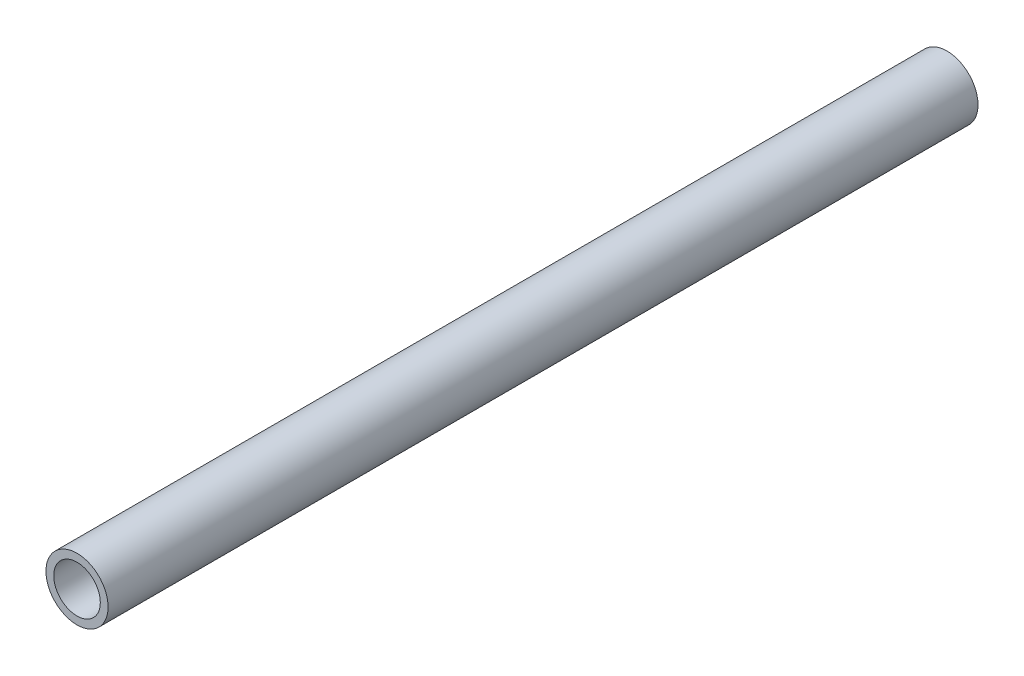
ISO-10303-21;
HEADER;
FILE_DESCRIPTION(('STEP AP214'),'2;1');
FILE_NAME('part.step','',(''),(''),'','','');
FILE_SCHEMA(('AUTOMOTIVE_DESIGN { 1 0 10303 214 1 1 1 1 }'));
ENDSEC;
DATA;
#1=APPLICATION_CONTEXT('core data for automotive mechanical design processes');
#2=APPLICATION_PROTOCOL_DEFINITION('international standard','automotive_design',2000,#1);
#3=PRODUCT_CONTEXT('',#1,'mechanical');
#4=PRODUCT('Part','Part','',(#3));
#5=PRODUCT_RELATED_PRODUCT_CATEGORY('part','',(#4));
#6=PRODUCT_DEFINITION_FORMATION('','',#4);
#7=PRODUCT_DEFINITION_CONTEXT('part definition',#1,'design');
#8=PRODUCT_DEFINITION('design','',#6,#7);
#9=PRODUCT_DEFINITION_SHAPE('','',#8);
#10=(LENGTH_UNIT() NAMED_UNIT(*) SI_UNIT(.MILLI.,.METRE.));
#11=(NAMED_UNIT(*) PLANE_ANGLE_UNIT() SI_UNIT($,.RADIAN.));
#12=(NAMED_UNIT(*) SI_UNIT($,.STERADIAN.) SOLID_ANGLE_UNIT());
#13=UNCERTAINTY_MEASURE_WITH_UNIT(LENGTH_MEASURE(1.E-05),#10,'distance_accuracy_value','');
#14=(GEOMETRIC_REPRESENTATION_CONTEXT(3) GLOBAL_UNCERTAINTY_ASSIGNED_CONTEXT((#13)) GLOBAL_UNIT_ASSIGNED_CONTEXT((#10,
#11,#12)) REPRESENTATION_CONTEXT('',''));
#15=CARTESIAN_POINT('',(0.,0.,0.));
#16=DIRECTION('',(0.,0.,1.));
#17=DIRECTION('',(1.,0.,0.));
#18=AXIS2_PLACEMENT_3D('',#15,#16,#17);
#19=CARTESIAN_POINT('',(0.,0.,355.6));
#20=DIRECTION('',(0.,0.,1.));
#21=DIRECTION('',(1.,0.,0.));
#22=AXIS2_PLACEMENT_3D('',#19,#20,#21);
#23=CYLINDRICAL_SURFACE('',#22,9.525);
#24=CARTESIAN_POINT('',(0.,0.,355.6));
#25=DIRECTION('',(0.,0.,1.));
#26=DIRECTION('',(1.,0.,0.));
#27=AXIS2_PLACEMENT_3D('',#24,#25,#26);
#28=CIRCLE('',#27,9.525);
#29=CARTESIAN_POINT('',(9.525,0.,355.6));
#30=VERTEX_POINT('',#29);
#31=EDGE_CURVE('E17',#30,#30,#28,.F.);
#32=ORIENTED_EDGE('',*,*,#31,.F.);
#33=EDGE_LOOP('',(#32));
#34=FACE_BOUND('',#33,.T.);
#35=CARTESIAN_POINT('',(0.,0.,0.));
#36=DIRECTION('',(0.,0.,1.));
#37=DIRECTION('',(1.,0.,0.));
#38=AXIS2_PLACEMENT_3D('',#35,#36,#37);
#39=CIRCLE('',#38,9.525);
#40=CARTESIAN_POINT('',(9.525,0.,0.));
#41=VERTEX_POINT('',#40);
#42=EDGE_CURVE('E26',#41,#41,#39,.F.);
#43=ORIENTED_EDGE('',*,*,#42,.T.);
#44=EDGE_LOOP('',(#43));
#45=FACE_BOUND('',#44,.T.);
#46=ADVANCED_FACE('F14',(#34,#45),#23,.F.);
#47=CARTESIAN_POINT('',(0.,0.,355.6));
#48=DIRECTION('',(0.,0.,1.));
#49=DIRECTION('',(1.,0.,0.));
#50=AXIS2_PLACEMENT_3D('',#47,#48,#49);
#51=PLANE('',#50);
#52=ORIENTED_EDGE('',*,*,#31,.T.);
#53=EDGE_LOOP('',(#52));
#54=FACE_BOUND('',#53,.T.);
#55=CARTESIAN_POINT('',(0.,0.,355.6));
#56=DIRECTION('',(0.,0.,1.));
#57=DIRECTION('',(1.,0.,0.));
#58=AXIS2_PLACEMENT_3D('',#55,#56,#57);
#59=CIRCLE('',#58,12.7);
#60=CARTESIAN_POINT('',(12.7,0.,355.6));
#61=VERTEX_POINT('',#60);
#62=EDGE_CURVE('E21',#61,#61,#59,.F.);
#63=ORIENTED_EDGE('',*,*,#62,.F.);
#64=EDGE_LOOP('',(#63));
#65=FACE_BOUND('',#64,.T.);
#66=ADVANCED_FACE('F34',(#54,#65),#51,.T.);
#67=CARTESIAN_POINT('',(0.,0.,0.));
#68=DIRECTION('',(0.,0.,1.));
#69=DIRECTION('',(1.,0.,0.));
#70=AXIS2_PLACEMENT_3D('',#67,#68,#69);
#71=PLANE('',#70);
#72=ORIENTED_EDGE('',*,*,#42,.F.);
#73=EDGE_LOOP('',(#72));
#74=FACE_BOUND('',#73,.T.);
#75=CARTESIAN_POINT('',(0.,0.,0.));
#76=DIRECTION('',(0.,0.,1.));
#77=DIRECTION('',(1.,0.,0.));
#78=AXIS2_PLACEMENT_3D('',#75,#76,#77);
#79=CIRCLE('',#78,12.7);
#80=CARTESIAN_POINT('',(12.7,0.,0.));
#81=VERTEX_POINT('',#80);
#82=EDGE_CURVE('E10',#81,#81,#79,.T.);
#83=ORIENTED_EDGE('',*,*,#82,.F.);
#84=EDGE_LOOP('',(#83));
#85=FACE_BOUND('',#84,.T.);
#86=ADVANCED_FACE('F42',(#74,#85),#71,.F.);
#87=CARTESIAN_POINT('',(0.,0.,0.));
#88=DIRECTION('',(0.,0.,1.));
#89=DIRECTION('',(1.,0.,0.));
#90=AXIS2_PLACEMENT_3D('',#87,#88,#89);
#91=CYLINDRICAL_SURFACE('',#90,12.7);
#92=ORIENTED_EDGE('',*,*,#62,.T.);
#93=EDGE_LOOP('',(#92));
#94=FACE_BOUND('',#93,.T.);
#95=ORIENTED_EDGE('',*,*,#82,.T.);
#96=EDGE_LOOP('',(#95));
#97=FACE_BOUND('',#96,.T.);
#98=ADVANCED_FACE('F43',(#94,#97),#91,.T.);
#99=CLOSED_SHELL('',(#46,#66,#86,#98));
#100=MANIFOLD_SOLID_BREP('B1',#99);
#101=ADVANCED_BREP_SHAPE_REPRESENTATION('',(#18,#100),#14);
#102=SHAPE_DEFINITION_REPRESENTATION(#9,#101);
ENDSEC;
END-ISO-10303-21;
